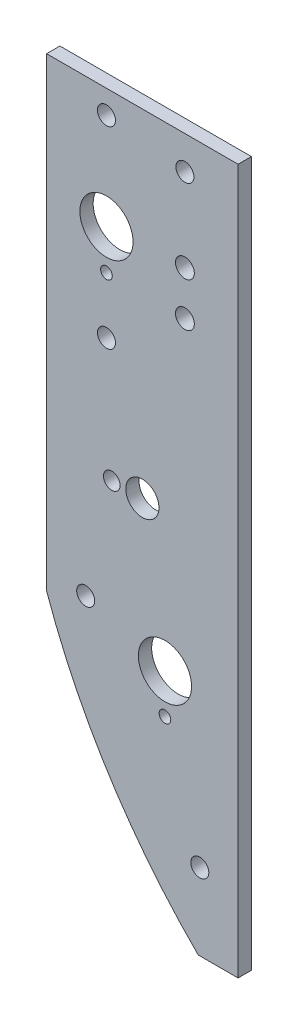
ISO-10303-21;
HEADER;
FILE_DESCRIPTION(('STEP AP214'),'2;1');
FILE_NAME('part.step','',(''),(''),'','','');
FILE_SCHEMA(('AUTOMOTIVE_DESIGN { 1 0 10303 214 1 1 1 1 }'));
ENDSEC;
DATA;
#1=APPLICATION_CONTEXT('core data for automotive mechanical design processes');
#2=APPLICATION_PROTOCOL_DEFINITION('international standard','automotive_design',2000,#1);
#3=PRODUCT_CONTEXT('',#1,'mechanical');
#4=PRODUCT('Part','Part','',(#3));
#5=PRODUCT_RELATED_PRODUCT_CATEGORY('part','',(#4));
#6=PRODUCT_DEFINITION_FORMATION('','',#4);
#7=PRODUCT_DEFINITION_CONTEXT('part definition',#1,'design');
#8=PRODUCT_DEFINITION('design','',#6,#7);
#9=PRODUCT_DEFINITION_SHAPE('','',#8);
#10=(LENGTH_UNIT() NAMED_UNIT(*) SI_UNIT(.MILLI.,.METRE.));
#11=(NAMED_UNIT(*) PLANE_ANGLE_UNIT() SI_UNIT($,.RADIAN.));
#12=(NAMED_UNIT(*) SI_UNIT($,.STERADIAN.) SOLID_ANGLE_UNIT());
#13=UNCERTAINTY_MEASURE_WITH_UNIT(LENGTH_MEASURE(1.E-05),#10,'distance_accuracy_value','');
#14=(GEOMETRIC_REPRESENTATION_CONTEXT(3) GLOBAL_UNCERTAINTY_ASSIGNED_CONTEXT((#13)) GLOBAL_UNIT_ASSIGNED_CONTEXT((#10,
#11,#12)) REPRESENTATION_CONTEXT('',''));
#15=CARTESIAN_POINT('',(0.,0.,0.));
#16=DIRECTION('',(0.,0.,1.));
#17=DIRECTION('',(1.,0.,0.));
#18=AXIS2_PLACEMENT_3D('',#15,#16,#17);
#19=CARTESIAN_POINT('',(0.,26.9875,-3.175));
#20=DIRECTION('',(0.,1.,0.));
#21=DIRECTION('',(-1.,0.,0.));
#22=AXIS2_PLACEMENT_3D('',#19,#20,#21);
#23=PLANE('',#22);
#24=DIRECTION('',(-1.,0.,0.));
#25=VECTOR('',#24,1.);
#26=CARTESIAN_POINT('',(0.,26.9875,0.));
#27=LINE('',#26,#25);
#28=CARTESIAN_POINT('',(0.,26.9875,0.));
#29=VERTEX_POINT('',#28);
#30=CARTESIAN_POINT('',(-45.7200000000001,26.9875,0.));
#31=VERTEX_POINT('',#30);
#32=EDGE_CURVE('E132',#29,#31,#27,.T.);
#33=ORIENTED_EDGE('',*,*,#32,.F.);
#34=DIRECTION('',(0.,0.,1.));
#35=VECTOR('',#34,1.);
#36=CARTESIAN_POINT('',(0.,26.9875,-3.175));
#37=LINE('',#36,#35);
#38=CARTESIAN_POINT('',(0.,26.9875,-3.175));
#39=VERTEX_POINT('',#38);
#40=EDGE_CURVE('E13',#39,#29,#37,.T.);
#41=ORIENTED_EDGE('',*,*,#40,.F.);
#42=DIRECTION('',(-1.,0.,0.));
#43=VECTOR('',#42,1.);
#44=CARTESIAN_POINT('',(0.,26.9875,-3.175));
#45=LINE('',#44,#43);
#46=CARTESIAN_POINT('',(-45.7200000000001,26.9875,-3.175));
#47=VERTEX_POINT('',#46);
#48=EDGE_CURVE('E127',#39,#47,#45,.T.);
#49=ORIENTED_EDGE('',*,*,#48,.T.);
#50=DIRECTION('',(0.,0.,1.));
#51=VECTOR('',#50,1.);
#52=CARTESIAN_POINT('',(-45.7200000000001,26.9875,-3.175));
#53=LINE('',#52,#51);
#54=EDGE_CURVE('E58',#47,#31,#53,.T.);
#55=ORIENTED_EDGE('',*,*,#54,.T.);
#56=EDGE_LOOP('',(#33,#41,#49,#55));
#57=FACE_BOUND('',#56,.T.);
#58=ADVANCED_FACE('F55',(#57),#23,.T.);
#59=CARTESIAN_POINT('',(0.,-141.2875,-3.175));
#60=DIRECTION('',(1.,0.,0.));
#61=DIRECTION('',(0.,1.,0.));
#62=AXIS2_PLACEMENT_3D('',#59,#60,#61);
#63=PLANE('',#62);
#64=DIRECTION('',(0.,1.,0.));
#65=VECTOR('',#64,1.);
#66=CARTESIAN_POINT('',(0.,-141.2875,0.));
#67=LINE('',#66,#65);
#68=CARTESIAN_POINT('',(0.,-141.2875,0.));
#69=VERTEX_POINT('',#68);
#70=EDGE_CURVE('E142',#69,#29,#67,.T.);
#71=ORIENTED_EDGE('',*,*,#70,.F.);
#72=DIRECTION('',(0.,0.,1.));
#73=VECTOR('',#72,1.);
#74=CARTESIAN_POINT('',(0.,-141.2875,-3.175));
#75=LINE('',#74,#73);
#76=CARTESIAN_POINT('',(0.,-141.2875,-3.175));
#77=VERTEX_POINT('',#76);
#78=EDGE_CURVE('E64',#77,#69,#75,.T.);
#79=ORIENTED_EDGE('',*,*,#78,.F.);
#80=DIRECTION('',(0.,1.,0.));
#81=VECTOR('',#80,1.);
#82=CARTESIAN_POINT('',(0.,-141.2875,-3.175));
#83=LINE('',#82,#81);
#84=EDGE_CURVE('E122',#77,#39,#83,.T.);
#85=ORIENTED_EDGE('',*,*,#84,.T.);
#86=ORIENTED_EDGE('',*,*,#40,.T.);
#87=EDGE_LOOP('',(#71,#79,#85,#86));
#88=FACE_BOUND('',#87,.T.);
#89=ADVANCED_FACE('F148',(#88),#63,.T.);
#90=CARTESIAN_POINT('',(-9.52499999999991,-141.2875,-3.175));
#91=DIRECTION('',(0.,-1.,0.));
#92=DIRECTION('',(1.,0.,0.));
#93=AXIS2_PLACEMENT_3D('',#90,#91,#92);
#94=PLANE('',#93);
#95=DIRECTION('',(1.,0.,0.));
#96=VECTOR('',#95,1.);
#97=CARTESIAN_POINT('',(-9.52499999999991,-141.2875,0.));
#98=LINE('',#97,#96);
#99=CARTESIAN_POINT('',(-9.52499999999991,-141.2875,0.));
#100=VERTEX_POINT('',#99);
#101=EDGE_CURVE('E111',#100,#69,#98,.T.);
#102=ORIENTED_EDGE('',*,*,#101,.F.);
#103=DIRECTION('',(0.,0.,1.));
#104=VECTOR('',#103,1.);
#105=CARTESIAN_POINT('',(-9.52499999999991,-141.2875,-3.175));
#106=LINE('',#105,#104);
#107=CARTESIAN_POINT('',(-9.52499999999991,-141.2875,-3.175));
#108=VERTEX_POINT('',#107);
#109=EDGE_CURVE('E106',#108,#100,#106,.T.);
#110=ORIENTED_EDGE('',*,*,#109,.F.);
#111=DIRECTION('',(1.,0.,0.));
#112=VECTOR('',#111,1.);
#113=CARTESIAN_POINT('',(-9.52499999999991,-141.2875,-3.175));
#114=LINE('',#113,#112);
#115=EDGE_CURVE('E109',#108,#77,#114,.T.);
#116=ORIENTED_EDGE('',*,*,#115,.T.);
#117=ORIENTED_EDGE('',*,*,#78,.T.);
#118=EDGE_LOOP('',(#102,#110,#116,#117));
#119=FACE_BOUND('',#118,.T.);
#120=ADVANCED_FACE('F108',(#119),#94,.T.);
#121=CARTESIAN_POINT('',(97.9169036036386,-33.2042110510285,-3.175));
#122=DIRECTION('',(0.,0.,1.));
#123=DIRECTION('',(1.,0.,0.));
#124=AXIS2_PLACEMENT_3D('',#121,#122,#123);
#125=CYLINDRICAL_SURFACE('',#124,152.400000000001);
#126=CARTESIAN_POINT('',(97.9169036036386,-33.2042110510285,0.));
#127=DIRECTION('',(0.,0.,1.));
#128=DIRECTION('',(1.,0.,0.));
#129=AXIS2_PLACEMENT_3D('',#126,#127,#128);
#130=CIRCLE('',#129,152.400000000001);
#131=CARTESIAN_POINT('',(-45.7200000000001,-84.1374999999997,0.));
#132=VERTEX_POINT('',#131);
#133=EDGE_CURVE('E139',#132,#100,#130,.T.);
#134=ORIENTED_EDGE('',*,*,#133,.F.);
#135=DIRECTION('',(0.,0.,1.));
#136=VECTOR('',#135,1.);
#137=CARTESIAN_POINT('',(-45.7200000000001,-84.1374999999997,-3.175));
#138=LINE('',#137,#136);
#139=CARTESIAN_POINT('',(-45.7200000000001,-84.1374999999997,-3.175));
#140=VERTEX_POINT('',#139);
#141=EDGE_CURVE('E116',#140,#132,#138,.T.);
#142=ORIENTED_EDGE('',*,*,#141,.F.);
#143=CARTESIAN_POINT('',(97.9169036036386,-33.2042110510285,-3.175));
#144=DIRECTION('',(0.,0.,1.));
#145=DIRECTION('',(1.,0.,0.));
#146=AXIS2_PLACEMENT_3D('',#143,#144,#145);
#147=CIRCLE('',#146,152.400000000001);
#148=EDGE_CURVE('E121',#140,#108,#147,.T.);
#149=ORIENTED_EDGE('',*,*,#148,.T.);
#150=ORIENTED_EDGE('',*,*,#109,.T.);
#151=EDGE_LOOP('',(#134,#142,#149,#150));
#152=FACE_BOUND('',#151,.T.);
#153=ADVANCED_FACE('F124',(#152),#125,.T.);
#154=CARTESIAN_POINT('',(-45.7200000000001,26.9875,-3.175));
#155=DIRECTION('',(-1.,0.,0.));
#156=DIRECTION('',(0.,-1.,0.));
#157=AXIS2_PLACEMENT_3D('',#154,#155,#156);
#158=PLANE('',#157);
#159=DIRECTION('',(0.,-1.,0.));
#160=VECTOR('',#159,1.);
#161=CARTESIAN_POINT('',(-45.7200000000001,26.9875,0.));
#162=LINE('',#161,#160);
#163=EDGE_CURVE('E135',#31,#132,#162,.T.);
#164=ORIENTED_EDGE('',*,*,#163,.F.);
#165=ORIENTED_EDGE('',*,*,#54,.F.);
#166=DIRECTION('',(0.,-1.,0.));
#167=VECTOR('',#166,1.);
#168=CARTESIAN_POINT('',(-45.7200000000001,26.9875,-3.175));
#169=LINE('',#168,#167);
#170=EDGE_CURVE('E125',#47,#140,#169,.T.);
#171=ORIENTED_EDGE('',*,*,#170,.T.);
#172=ORIENTED_EDGE('',*,*,#141,.T.);
#173=EDGE_LOOP('',(#164,#165,#171,#172));
#174=FACE_BOUND('',#173,.T.);
#175=ADVANCED_FACE('F145',(#174),#158,.T.);
#176=CARTESIAN_POINT('',(97.9169036036386,-33.2042110510285,-3.175));
#177=DIRECTION('',(0.,0.,1.));
#178=DIRECTION('',(1.,0.,0.));
#179=AXIS2_PLACEMENT_3D('',#176,#177,#178);
#180=PLANE('',#179);
#181=CARTESIAN_POINT('',(-12.700000000001,-0.780389216199246,-3.175));
#182=DIRECTION('',(0.,0.,-1.));
#183=DIRECTION('',(-1.,0.,0.));
#184=AXIS2_PLACEMENT_3D('',#181,#182,#183);
#185=CIRCLE('',#184,2.2479);
#186=CARTESIAN_POINT('',(-14.947900000001,-0.780389216199246,-3.175));
#187=VERTEX_POINT('',#186);
#188=EDGE_CURVE('E230',#187,#187,#185,.T.);
#189=ORIENTED_EDGE('',*,*,#188,.F.);
#190=EDGE_LOOP('',(#189));
#191=FACE_BOUND('',#190,.T.);
#192=CARTESIAN_POINT('',(-12.700000000001,-11.284610783795,-3.175));
#193=DIRECTION('',(0.,0.,-1.));
#194=DIRECTION('',(-1.,0.,0.));
#195=AXIS2_PLACEMENT_3D('',#192,#193,#194);
#196=CIRCLE('',#195,2.2479);
#197=CARTESIAN_POINT('',(-14.947900000001,-11.284610783795,-3.175));
#198=VERTEX_POINT('',#197);
#199=EDGE_CURVE('E232',#198,#198,#196,.T.);
#200=ORIENTED_EDGE('',*,*,#199,.F.);
#201=EDGE_LOOP('',(#200));
#202=FACE_BOUND('',#201,.T.);
#203=CARTESIAN_POINT('',(-12.7,19.05,-3.175));
#204=DIRECTION('',(0.,0.,-1.));
#205=DIRECTION('',(-1.,0.,0.));
#206=AXIS2_PLACEMENT_3D('',#203,#204,#205);
#207=CIRCLE('',#206,2.15265);
#208=CARTESIAN_POINT('',(-14.85265,19.05,-3.175));
#209=VERTEX_POINT('',#208);
#210=EDGE_CURVE('E240',#209,#209,#207,.T.);
#211=ORIENTED_EDGE('',*,*,#210,.F.);
#212=EDGE_LOOP('',(#211));
#213=FACE_BOUND('',#212,.T.);
#214=CARTESIAN_POINT('',(-36.3855,-80.4545,-3.175));
#215=DIRECTION('',(0.,0.,-1.));
#216=DIRECTION('',(-1.,0.,0.));
#217=AXIS2_PLACEMENT_3D('',#214,#215,#216);
#218=CIRCLE('',#217,2.15264999999999);
#219=CARTESIAN_POINT('',(-38.53815,-80.4545,-3.175));
#220=VERTEX_POINT('',#219);
#221=EDGE_CURVE('E246',#220,#220,#218,.T.);
#222=ORIENTED_EDGE('',*,*,#221,.F.);
#223=EDGE_LOOP('',(#222));
#224=FACE_BOUND('',#223,.T.);
#225=CARTESIAN_POINT('',(-9.14400000000002,-122.9995,-3.175));
#226=DIRECTION('',(0.,0.,-1.));
#227=DIRECTION('',(-1.,0.,0.));
#228=AXIS2_PLACEMENT_3D('',#225,#226,#227);
#229=CIRCLE('',#228,2.15265);
#230=CARTESIAN_POINT('',(-11.29665,-122.9995,-3.175));
#231=VERTEX_POINT('',#230);
#232=EDGE_CURVE('E252',#231,#231,#229,.T.);
#233=ORIENTED_EDGE('',*,*,#232,.F.);
#234=EDGE_LOOP('',(#233));
#235=FACE_BOUND('',#234,.T.);
#236=CARTESIAN_POINT('',(-31.4324999999997,-24.6200456119563,-3.175));
#237=DIRECTION('',(0.,0.,-1.));
#238=DIRECTION('',(-1.,0.,0.));
#239=AXIS2_PLACEMENT_3D('',#236,#237,#238);
#240=CIRCLE('',#239,2.15265);
#241=CARTESIAN_POINT('',(-33.5851499999997,-24.6200456119563,-3.175));
#242=VERTEX_POINT('',#241);
#243=EDGE_CURVE('E258',#242,#242,#240,.T.);
#244=ORIENTED_EDGE('',*,*,#243,.F.);
#245=EDGE_LOOP('',(#244));
#246=FACE_BOUND('',#245,.T.);
#247=CARTESIAN_POINT('',(-31.4324999999997,21.4047543880437,-3.175));
#248=DIRECTION('',(0.,0.,-1.));
#249=DIRECTION('',(-1.,0.,0.));
#250=AXIS2_PLACEMENT_3D('',#247,#248,#249);
#251=CIRCLE('',#250,2.15265);
#252=CARTESIAN_POINT('',(-33.5851499999997,21.4047543880437,-3.175));
#253=VERTEX_POINT('',#252);
#254=EDGE_CURVE('E264',#253,#253,#251,.T.);
#255=ORIENTED_EDGE('',*,*,#254,.F.);
#256=EDGE_LOOP('',(#255));
#257=FACE_BOUND('',#256,.T.);
#258=CARTESIAN_POINT('',(-17.4646356254616,-95.9667192417854,-3.175));
#259=DIRECTION('',(0.,0.,1.));
#260=DIRECTION('',(1.,0.,0.));
#261=AXIS2_PLACEMENT_3D('',#258,#259,#260);
#262=CIRCLE('',#261,1.389126);
#263=CARTESIAN_POINT('',(-16.0755096254616,-95.9667192417854,-3.175));
#264=VERTEX_POINT('',#263);
#265=EDGE_CURVE('E273',#264,#264,#262,.T.);
#266=ORIENTED_EDGE('',*,*,#265,.T.);
#267=EDGE_LOOP('',(#266));
#268=FACE_BOUND('',#267,.T.);
#269=CARTESIAN_POINT('',(-31.4324999999997,-11.1588580506611,-3.175));
#270=DIRECTION('',(0.,0.,1.));
#271=DIRECTION('',(1.,0.,0.));
#272=AXIS2_PLACEMENT_3D('',#269,#270,#271);
#273=CIRCLE('',#272,1.389126);
#274=CARTESIAN_POINT('',(-30.0433739999997,-11.1588580506611,-3.175));
#275=VERTEX_POINT('',#274);
#276=EDGE_CURVE('E279',#275,#275,#273,.T.);
#277=ORIENTED_EDGE('',*,*,#276,.T.);
#278=EDGE_LOOP('',(#277));
#279=FACE_BOUND('',#278,.T.);
#280=CARTESIAN_POINT('',(-30.161117219358,-53.5304999999975,-3.175));
#281=DIRECTION('',(0.,0.,1.));
#282=DIRECTION('',(1.,0.,0.));
#283=AXIS2_PLACEMENT_3D('',#280,#281,#282);
#284=CIRCLE('',#283,1.984375);
#285=CARTESIAN_POINT('',(-28.1767422193581,-53.5304999999975,-3.175));
#286=VERTEX_POINT('',#285);
#287=EDGE_CURVE('E285',#286,#286,#284,.T.);
#288=ORIENTED_EDGE('',*,*,#287,.T.);
#289=EDGE_LOOP('',(#288));
#290=FACE_BOUND('',#289,.T.);
#291=CARTESIAN_POINT('',(-22.8599999999813,-53.5304999999975,-3.175));
#292=DIRECTION('',(0.,0.,1.));
#293=DIRECTION('',(1.,0.,0.));
#294=AXIS2_PLACEMENT_3D('',#291,#292,#293);
#295=CIRCLE('',#294,3.96875);
#296=CARTESIAN_POINT('',(-18.8912499999813,-53.5304999999975,-3.175));
#297=VERTEX_POINT('',#296);
#298=EDGE_CURVE('E291',#297,#297,#295,.T.);
#299=ORIENTED_EDGE('',*,*,#298,.T.);
#300=EDGE_LOOP('',(#299));
#301=FACE_BOUND('',#300,.T.);
#302=CARTESIAN_POINT('',(-17.4624999999998,-86.5504999999962,-3.175));
#303=DIRECTION('',(0.,0.,1.));
#304=DIRECTION('',(1.,0.,0.));
#305=AXIS2_PLACEMENT_3D('',#302,#303,#304);
#306=CIRCLE('',#305,6.35);
#307=CARTESIAN_POINT('',(-11.1124999999998,-86.5504999999962,-3.175));
#308=VERTEX_POINT('',#307);
#309=EDGE_CURVE('E297',#308,#308,#306,.T.);
#310=ORIENTED_EDGE('',*,*,#309,.T.);
#311=EDGE_LOOP('',(#310));
#312=FACE_BOUND('',#311,.T.);
#313=CARTESIAN_POINT('',(-31.4324999999998,-1.62034561195568,-3.175));
#314=DIRECTION('',(0.,0.,1.));
#315=DIRECTION('',(1.,0.,0.));
#316=AXIS2_PLACEMENT_3D('',#313,#314,#315);
#317=CIRCLE('',#316,6.35);
#318=CARTESIAN_POINT('',(-25.0824999999998,-1.62034561195568,-3.175));
#319=VERTEX_POINT('',#318);
#320=EDGE_CURVE('E136',#319,#319,#317,.T.);
#321=ORIENTED_EDGE('',*,*,#320,.T.);
#322=EDGE_LOOP('',(#321));
#323=FACE_BOUND('',#322,.T.);
#324=ORIENTED_EDGE('',*,*,#48,.F.);
#325=ORIENTED_EDGE('',*,*,#84,.F.);
#326=ORIENTED_EDGE('',*,*,#115,.F.);
#327=ORIENTED_EDGE('',*,*,#148,.F.);
#328=ORIENTED_EDGE('',*,*,#170,.F.);
#329=EDGE_LOOP('',(#324,#325,#326,#327,#328));
#330=FACE_BOUND('',#329,.T.);
#331=ADVANCED_FACE('F120',(#191,#202,#213,#224,#235,#246,#257,#268,#279,#290,#301,#312,#323,
#330),#180,.F.);
#332=CARTESIAN_POINT('',(97.9169036036386,-33.2042110510285,0.));
#333=DIRECTION('',(0.,0.,1.));
#334=DIRECTION('',(1.,0.,0.));
#335=AXIS2_PLACEMENT_3D('',#332,#333,#334);
#336=PLANE('',#335);
#337=CARTESIAN_POINT('',(-12.700000000001,-0.780389216199246,0.));
#338=DIRECTION('',(0.,0.,-1.));
#339=DIRECTION('',(-1.,0.,0.));
#340=AXIS2_PLACEMENT_3D('',#337,#338,#339);
#341=CIRCLE('',#340,2.2479);
#342=CARTESIAN_POINT('',(-14.947900000001,-0.780389216199246,0.));
#343=VERTEX_POINT('',#342);
#344=EDGE_CURVE('E228',#343,#343,#341,.T.);
#345=ORIENTED_EDGE('',*,*,#344,.T.);
#346=EDGE_LOOP('',(#345));
#347=FACE_BOUND('',#346,.T.);
#348=CARTESIAN_POINT('',(-12.700000000001,-11.284610783795,0.));
#349=DIRECTION('',(0.,0.,-1.));
#350=DIRECTION('',(-1.,0.,0.));
#351=AXIS2_PLACEMENT_3D('',#348,#349,#350);
#352=CIRCLE('',#351,2.2479);
#353=CARTESIAN_POINT('',(-14.947900000001,-11.284610783795,0.));
#354=VERTEX_POINT('',#353);
#355=EDGE_CURVE('E237',#354,#354,#352,.T.);
#356=ORIENTED_EDGE('',*,*,#355,.T.);
#357=EDGE_LOOP('',(#356));
#358=FACE_BOUND('',#357,.T.);
#359=CARTESIAN_POINT('',(-12.7,19.05,0.));
#360=DIRECTION('',(0.,0.,-1.));
#361=DIRECTION('',(-1.,0.,0.));
#362=AXIS2_PLACEMENT_3D('',#359,#360,#361);
#363=CIRCLE('',#362,2.15265);
#364=CARTESIAN_POINT('',(-14.85265,19.05,0.));
#365=VERTEX_POINT('',#364);
#366=EDGE_CURVE('E243',#365,#365,#363,.T.);
#367=ORIENTED_EDGE('',*,*,#366,.T.);
#368=EDGE_LOOP('',(#367));
#369=FACE_BOUND('',#368,.T.);
#370=CARTESIAN_POINT('',(-36.3855,-80.4545,0.));
#371=DIRECTION('',(0.,0.,-1.));
#372=DIRECTION('',(-1.,0.,0.));
#373=AXIS2_PLACEMENT_3D('',#370,#371,#372);
#374=CIRCLE('',#373,2.15265);
#375=CARTESIAN_POINT('',(-38.53815,-80.4545,0.));
#376=VERTEX_POINT('',#375);
#377=EDGE_CURVE('E249',#376,#376,#374,.T.);
#378=ORIENTED_EDGE('',*,*,#377,.T.);
#379=EDGE_LOOP('',(#378));
#380=FACE_BOUND('',#379,.T.);
#381=CARTESIAN_POINT('',(-9.14400000000002,-122.9995,0.));
#382=DIRECTION('',(0.,0.,-1.));
#383=DIRECTION('',(-1.,0.,0.));
#384=AXIS2_PLACEMENT_3D('',#381,#382,#383);
#385=CIRCLE('',#384,2.15265);
#386=CARTESIAN_POINT('',(-11.29665,-122.9995,0.));
#387=VERTEX_POINT('',#386);
#388=EDGE_CURVE('E255',#387,#387,#385,.T.);
#389=ORIENTED_EDGE('',*,*,#388,.T.);
#390=EDGE_LOOP('',(#389));
#391=FACE_BOUND('',#390,.T.);
#392=CARTESIAN_POINT('',(-31.4324999999997,-24.6200456119563,0.));
#393=DIRECTION('',(0.,0.,-1.));
#394=DIRECTION('',(-1.,0.,0.));
#395=AXIS2_PLACEMENT_3D('',#392,#393,#394);
#396=CIRCLE('',#395,2.15265);
#397=CARTESIAN_POINT('',(-33.5851499999997,-24.6200456119563,0.));
#398=VERTEX_POINT('',#397);
#399=EDGE_CURVE('E261',#398,#398,#396,.T.);
#400=ORIENTED_EDGE('',*,*,#399,.T.);
#401=EDGE_LOOP('',(#400));
#402=FACE_BOUND('',#401,.T.);
#403=CARTESIAN_POINT('',(-31.4324999999997,21.4047543880437,0.));
#404=DIRECTION('',(0.,0.,-1.));
#405=DIRECTION('',(-1.,0.,0.));
#406=AXIS2_PLACEMENT_3D('',#403,#404,#405);
#407=CIRCLE('',#406,2.15265);
#408=CARTESIAN_POINT('',(-33.5851499999997,21.4047543880437,0.));
#409=VERTEX_POINT('',#408);
#410=EDGE_CURVE('E267',#409,#409,#407,.T.);
#411=ORIENTED_EDGE('',*,*,#410,.T.);
#412=EDGE_LOOP('',(#411));
#413=FACE_BOUND('',#412,.T.);
#414=CARTESIAN_POINT('',(-17.4646356254616,-95.9667192417854,0.));
#415=DIRECTION('',(0.,0.,1.));
#416=DIRECTION('',(1.,0.,0.));
#417=AXIS2_PLACEMENT_3D('',#414,#415,#416);
#418=CIRCLE('',#417,1.389126);
#419=CARTESIAN_POINT('',(-16.0755096254616,-95.9667192417854,0.));
#420=VERTEX_POINT('',#419);
#421=EDGE_CURVE('E270',#420,#420,#418,.T.);
#422=ORIENTED_EDGE('',*,*,#421,.F.);
#423=EDGE_LOOP('',(#422));
#424=FACE_BOUND('',#423,.T.);
#425=CARTESIAN_POINT('',(-31.4324999999997,-11.1588580506611,0.));
#426=DIRECTION('',(0.,0.,1.));
#427=DIRECTION('',(1.,0.,0.));
#428=AXIS2_PLACEMENT_3D('',#425,#426,#427);
#429=CIRCLE('',#428,1.389126);
#430=CARTESIAN_POINT('',(-30.0433739999997,-11.1588580506611,0.));
#431=VERTEX_POINT('',#430);
#432=EDGE_CURVE('E276',#431,#431,#429,.T.);
#433=ORIENTED_EDGE('',*,*,#432,.F.);
#434=EDGE_LOOP('',(#433));
#435=FACE_BOUND('',#434,.T.);
#436=CARTESIAN_POINT('',(-30.161117219358,-53.5304999999975,0.));
#437=DIRECTION('',(0.,0.,1.));
#438=DIRECTION('',(1.,0.,0.));
#439=AXIS2_PLACEMENT_3D('',#436,#437,#438);
#440=CIRCLE('',#439,1.984375);
#441=CARTESIAN_POINT('',(-28.1767422193581,-53.5304999999975,0.));
#442=VERTEX_POINT('',#441);
#443=EDGE_CURVE('E282',#442,#442,#440,.T.);
#444=ORIENTED_EDGE('',*,*,#443,.F.);
#445=EDGE_LOOP('',(#444));
#446=FACE_BOUND('',#445,.T.);
#447=CARTESIAN_POINT('',(-22.8599999999813,-53.5304999999975,0.));
#448=DIRECTION('',(0.,0.,1.));
#449=DIRECTION('',(1.,0.,0.));
#450=AXIS2_PLACEMENT_3D('',#447,#448,#449);
#451=CIRCLE('',#450,3.96875);
#452=CARTESIAN_POINT('',(-18.8912499999813,-53.5304999999975,0.));
#453=VERTEX_POINT('',#452);
#454=EDGE_CURVE('E288',#453,#453,#451,.T.);
#455=ORIENTED_EDGE('',*,*,#454,.F.);
#456=EDGE_LOOP('',(#455));
#457=FACE_BOUND('',#456,.T.);
#458=CARTESIAN_POINT('',(-17.4624999999998,-86.5504999999962,0.));
#459=DIRECTION('',(0.,0.,1.));
#460=DIRECTION('',(1.,0.,0.));
#461=AXIS2_PLACEMENT_3D('',#458,#459,#460);
#462=CIRCLE('',#461,6.35);
#463=CARTESIAN_POINT('',(-11.1124999999998,-86.5504999999962,0.));
#464=VERTEX_POINT('',#463);
#465=EDGE_CURVE('E294',#464,#464,#462,.T.);
#466=ORIENTED_EDGE('',*,*,#465,.F.);
#467=EDGE_LOOP('',(#466));
#468=FACE_BOUND('',#467,.T.);
#469=CARTESIAN_POINT('',(-31.4324999999998,-1.62034561195568,0.));
#470=DIRECTION('',(0.,0.,1.));
#471=DIRECTION('',(1.,0.,0.));
#472=AXIS2_PLACEMENT_3D('',#469,#470,#471);
#473=CIRCLE('',#472,6.35);
#474=CARTESIAN_POINT('',(-25.0824999999998,-1.62034561195568,0.));
#475=VERTEX_POINT('',#474);
#476=EDGE_CURVE('E300',#475,#475,#473,.T.);
#477=ORIENTED_EDGE('',*,*,#476,.F.);
#478=EDGE_LOOP('',(#477));
#479=FACE_BOUND('',#478,.T.);
#480=ORIENTED_EDGE('',*,*,#32,.T.);
#481=ORIENTED_EDGE('',*,*,#163,.T.);
#482=ORIENTED_EDGE('',*,*,#133,.T.);
#483=ORIENTED_EDGE('',*,*,#101,.T.);
#484=ORIENTED_EDGE('',*,*,#70,.T.);
#485=EDGE_LOOP('',(#480,#481,#482,#483,#484));
#486=FACE_BOUND('',#485,.T.);
#487=ADVANCED_FACE('F147',(#347,#358,#369,#380,#391,#402,#413,#424,#435,#446,#457,#468,#479,
#486),#336,.T.);
#488=CARTESIAN_POINT('',(-31.4324999999998,-1.62034561195568,0.));
#489=DIRECTION('',(0.,0.,1.));
#490=DIRECTION('',(1.,0.,0.));
#491=AXIS2_PLACEMENT_3D('',#488,#489,#490);
#492=CYLINDRICAL_SURFACE('',#491,6.35);
#493=ORIENTED_EDGE('',*,*,#320,.F.);
#494=EDGE_LOOP('',(#493));
#495=FACE_BOUND('',#494,.T.);
#496=ORIENTED_EDGE('',*,*,#476,.T.);
#497=EDGE_LOOP('',(#496));
#498=FACE_BOUND('',#497,.T.);
#499=ADVANCED_FACE('F168',(#495,#498),#492,.F.);
#500=CARTESIAN_POINT('',(-17.4624999999998,-86.5504999999962,0.));
#501=DIRECTION('',(0.,0.,1.));
#502=DIRECTION('',(1.,0.,0.));
#503=AXIS2_PLACEMENT_3D('',#500,#501,#502);
#504=CYLINDRICAL_SURFACE('',#503,6.35);
#505=ORIENTED_EDGE('',*,*,#309,.F.);
#506=EDGE_LOOP('',(#505));
#507=FACE_BOUND('',#506,.T.);
#508=ORIENTED_EDGE('',*,*,#465,.T.);
#509=EDGE_LOOP('',(#508));
#510=FACE_BOUND('',#509,.T.);
#511=ADVANCED_FACE('F175',(#507,#510),#504,.F.);
#512=CARTESIAN_POINT('',(-22.8599999999813,-53.5304999999975,0.));
#513=DIRECTION('',(0.,0.,1.));
#514=DIRECTION('',(1.,0.,0.));
#515=AXIS2_PLACEMENT_3D('',#512,#513,#514);
#516=CYLINDRICAL_SURFACE('',#515,3.96875);
#517=ORIENTED_EDGE('',*,*,#298,.F.);
#518=EDGE_LOOP('',(#517));
#519=FACE_BOUND('',#518,.T.);
#520=ORIENTED_EDGE('',*,*,#454,.T.);
#521=EDGE_LOOP('',(#520));
#522=FACE_BOUND('',#521,.T.);
#523=ADVANCED_FACE('F179',(#519,#522),#516,.F.);
#524=CARTESIAN_POINT('',(-30.161117219358,-53.5304999999975,0.));
#525=DIRECTION('',(0.,0.,1.));
#526=DIRECTION('',(1.,0.,0.));
#527=AXIS2_PLACEMENT_3D('',#524,#525,#526);
#528=CYLINDRICAL_SURFACE('',#527,1.984375);
#529=ORIENTED_EDGE('',*,*,#287,.F.);
#530=EDGE_LOOP('',(#529));
#531=FACE_BOUND('',#530,.T.);
#532=ORIENTED_EDGE('',*,*,#443,.T.);
#533=EDGE_LOOP('',(#532));
#534=FACE_BOUND('',#533,.T.);
#535=ADVANCED_FACE('F183',(#531,#534),#528,.F.);
#536=CARTESIAN_POINT('',(-31.4324999999997,-11.1588580506611,0.));
#537=DIRECTION('',(0.,0.,1.));
#538=DIRECTION('',(1.,0.,0.));
#539=AXIS2_PLACEMENT_3D('',#536,#537,#538);
#540=CYLINDRICAL_SURFACE('',#539,1.389126);
#541=ORIENTED_EDGE('',*,*,#276,.F.);
#542=EDGE_LOOP('',(#541));
#543=FACE_BOUND('',#542,.T.);
#544=ORIENTED_EDGE('',*,*,#432,.T.);
#545=EDGE_LOOP('',(#544));
#546=FACE_BOUND('',#545,.T.);
#547=ADVANCED_FACE('F187',(#543,#546),#540,.F.);
#548=CARTESIAN_POINT('',(-17.4646356254616,-95.9667192417854,0.));
#549=DIRECTION('',(0.,0.,1.));
#550=DIRECTION('',(1.,0.,0.));
#551=AXIS2_PLACEMENT_3D('',#548,#549,#550);
#552=CYLINDRICAL_SURFACE('',#551,1.389126);
#553=ORIENTED_EDGE('',*,*,#265,.F.);
#554=EDGE_LOOP('',(#553));
#555=FACE_BOUND('',#554,.T.);
#556=ORIENTED_EDGE('',*,*,#421,.T.);
#557=EDGE_LOOP('',(#556));
#558=FACE_BOUND('',#557,.T.);
#559=ADVANCED_FACE('F191',(#555,#558),#552,.F.);
#560=CARTESIAN_POINT('',(-31.4324999999997,21.4047543880437,-3.175));
#561=DIRECTION('',(0.,0.,-1.));
#562=DIRECTION('',(-1.,0.,0.));
#563=AXIS2_PLACEMENT_3D('',#560,#561,#562);
#564=CYLINDRICAL_SURFACE('',#563,2.15265);
#565=ORIENTED_EDGE('',*,*,#410,.F.);
#566=EDGE_LOOP('',(#565));
#567=FACE_BOUND('',#566,.T.);
#568=ORIENTED_EDGE('',*,*,#254,.T.);
#569=EDGE_LOOP('',(#568));
#570=FACE_BOUND('',#569,.T.);
#571=ADVANCED_FACE('F195',(#567,#570),#564,.F.);
#572=CARTESIAN_POINT('',(-31.4324999999997,-24.6200456119563,-3.175));
#573=DIRECTION('',(0.,0.,-1.));
#574=DIRECTION('',(-1.,0.,0.));
#575=AXIS2_PLACEMENT_3D('',#572,#573,#574);
#576=CYLINDRICAL_SURFACE('',#575,2.15265);
#577=ORIENTED_EDGE('',*,*,#399,.F.);
#578=EDGE_LOOP('',(#577));
#579=FACE_BOUND('',#578,.T.);
#580=ORIENTED_EDGE('',*,*,#243,.T.);
#581=EDGE_LOOP('',(#580));
#582=FACE_BOUND('',#581,.T.);
#583=ADVANCED_FACE('F199',(#579,#582),#576,.F.);
#584=CARTESIAN_POINT('',(-9.14400000000002,-122.9995,-3.175));
#585=DIRECTION('',(0.,0.,-1.));
#586=DIRECTION('',(-1.,0.,0.));
#587=AXIS2_PLACEMENT_3D('',#584,#585,#586);
#588=CYLINDRICAL_SURFACE('',#587,2.15265);
#589=ORIENTED_EDGE('',*,*,#388,.F.);
#590=EDGE_LOOP('',(#589));
#591=FACE_BOUND('',#590,.T.);
#592=ORIENTED_EDGE('',*,*,#232,.T.);
#593=EDGE_LOOP('',(#592));
#594=FACE_BOUND('',#593,.T.);
#595=ADVANCED_FACE('F203',(#591,#594),#588,.F.);
#596=CARTESIAN_POINT('',(-36.3855,-80.4545,-3.175));
#597=DIRECTION('',(0.,0.,-1.));
#598=DIRECTION('',(-1.,0.,0.));
#599=AXIS2_PLACEMENT_3D('',#596,#597,#598);
#600=CYLINDRICAL_SURFACE('',#599,2.15265);
#601=ORIENTED_EDGE('',*,*,#377,.F.);
#602=EDGE_LOOP('',(#601));
#603=FACE_BOUND('',#602,.T.);
#604=ORIENTED_EDGE('',*,*,#221,.T.);
#605=EDGE_LOOP('',(#604));
#606=FACE_BOUND('',#605,.T.);
#607=ADVANCED_FACE('F207',(#603,#606),#600,.F.);
#608=CARTESIAN_POINT('',(-12.7,19.05,-3.175));
#609=DIRECTION('',(0.,0.,-1.));
#610=DIRECTION('',(-1.,0.,0.));
#611=AXIS2_PLACEMENT_3D('',#608,#609,#610);
#612=CYLINDRICAL_SURFACE('',#611,2.15265);
#613=ORIENTED_EDGE('',*,*,#366,.F.);
#614=EDGE_LOOP('',(#613));
#615=FACE_BOUND('',#614,.T.);
#616=ORIENTED_EDGE('',*,*,#210,.T.);
#617=EDGE_LOOP('',(#616));
#618=FACE_BOUND('',#617,.T.);
#619=ADVANCED_FACE('F211',(#615,#618),#612,.F.);
#620=CARTESIAN_POINT('',(-12.700000000001,-11.284610783795,-3.175));
#621=DIRECTION('',(0.,0.,-1.));
#622=DIRECTION('',(-1.,0.,0.));
#623=AXIS2_PLACEMENT_3D('',#620,#621,#622);
#624=CYLINDRICAL_SURFACE('',#623,2.2479);
#625=ORIENTED_EDGE('',*,*,#355,.F.);
#626=EDGE_LOOP('',(#625));
#627=FACE_BOUND('',#626,.T.);
#628=ORIENTED_EDGE('',*,*,#199,.T.);
#629=EDGE_LOOP('',(#628));
#630=FACE_BOUND('',#629,.T.);
#631=ADVANCED_FACE('F215',(#627,#630),#624,.F.);
#632=CARTESIAN_POINT('',(-12.700000000001,-0.780389216199246,-3.175));
#633=DIRECTION('',(0.,0.,-1.));
#634=DIRECTION('',(-1.,0.,0.));
#635=AXIS2_PLACEMENT_3D('',#632,#633,#634);
#636=CYLINDRICAL_SURFACE('',#635,2.2479);
#637=ORIENTED_EDGE('',*,*,#344,.F.);
#638=EDGE_LOOP('',(#637));
#639=FACE_BOUND('',#638,.T.);
#640=ORIENTED_EDGE('',*,*,#188,.T.);
#641=EDGE_LOOP('',(#640));
#642=FACE_BOUND('',#641,.T.);
#643=ADVANCED_FACE('F219',(#639,#642),#636,.F.);
#644=CLOSED_SHELL('',(#58,#89,#120,#153,#175,#331,#487,#499,#511,#523,#535,#547,#559,#571,#583,
#595,#607,#619,#631,#643));
#645=MANIFOLD_SOLID_BREP('B2',#644);
#646=ADVANCED_BREP_SHAPE_REPRESENTATION('',(#18,#645),#14);
#647=SHAPE_DEFINITION_REPRESENTATION(#9,#646);
ENDSEC;
END-ISO-10303-21;
